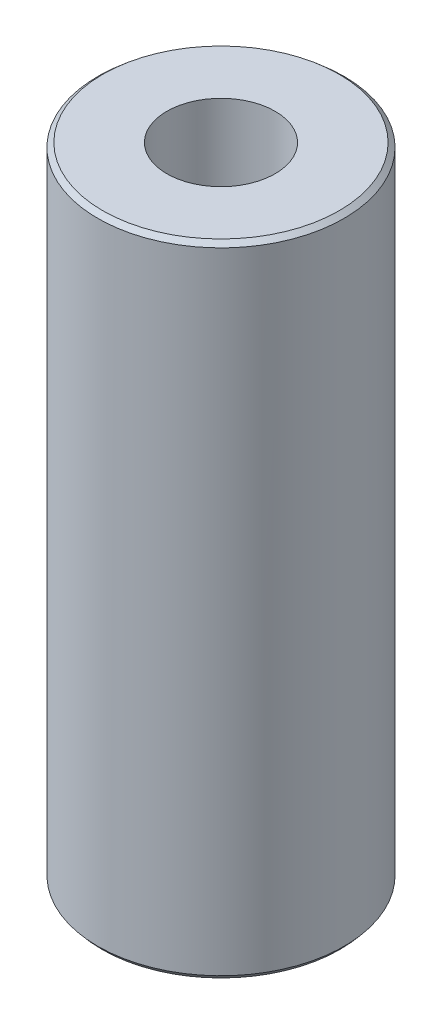
ISO-10303-21;
HEADER;
FILE_DESCRIPTION(('STEP AP214'),'2;1');
FILE_NAME('part.step','',(''),(''),'','','');
FILE_SCHEMA(('AUTOMOTIVE_DESIGN { 1 0 10303 214 1 1 1 1 }'));
ENDSEC;
DATA;
#1=APPLICATION_CONTEXT('core data for automotive mechanical design processes');
#2=APPLICATION_PROTOCOL_DEFINITION('international standard','automotive_design',2000,#1);
#3=PRODUCT_CONTEXT('',#1,'mechanical');
#4=PRODUCT('Part','Part','',(#3));
#5=PRODUCT_RELATED_PRODUCT_CATEGORY('part','',(#4));
#6=PRODUCT_DEFINITION_FORMATION('','',#4);
#7=PRODUCT_DEFINITION_CONTEXT('part definition',#1,'design');
#8=PRODUCT_DEFINITION('design','',#6,#7);
#9=PRODUCT_DEFINITION_SHAPE('','',#8);
#10=(LENGTH_UNIT() NAMED_UNIT(*) SI_UNIT(.MILLI.,.METRE.));
#11=(NAMED_UNIT(*) PLANE_ANGLE_UNIT() SI_UNIT($,.RADIAN.));
#12=(NAMED_UNIT(*) SI_UNIT($,.STERADIAN.) SOLID_ANGLE_UNIT());
#13=UNCERTAINTY_MEASURE_WITH_UNIT(LENGTH_MEASURE(1.E-05),#10,'distance_accuracy_value','');
#14=(GEOMETRIC_REPRESENTATION_CONTEXT(3) GLOBAL_UNCERTAINTY_ASSIGNED_CONTEXT((#13)) GLOBAL_UNIT_ASSIGNED_CONTEXT((#10,
#11,#12)) REPRESENTATION_CONTEXT('',''));
#15=CARTESIAN_POINT('',(0.,0.,0.));
#16=DIRECTION('',(0.,0.,1.));
#17=DIRECTION('',(1.,0.,0.));
#18=AXIS2_PLACEMENT_3D('',#15,#16,#17);
#19=CARTESIAN_POINT('',(0.,207.799958913587,0.));
#20=DIRECTION('',(0.,-1.,0.));
#21=DIRECTION('',(0.,0.,-1.));
#22=AXIS2_PLACEMENT_3D('',#19,#20,#21);
#23=CYLINDRICAL_SURFACE('',#22,40.);
#24=CARTESIAN_POINT('',(0.,206.424225681168,0.));
#25=DIRECTION('',(0.,1.,0.));
#26=DIRECTION('',(0.,0.,1.));
#27=AXIS2_PLACEMENT_3D('',#24,#25,#26);
#28=CIRCLE('',#27,40.);
#29=CARTESIAN_POINT('',(0.,206.424225681168,-40.));
#30=VERTEX_POINT('',#29);
#31=EDGE_CURVE('E50',#30,#30,#28,.F.);
#32=CARTESIAN_POINT('',(0.,1.59579462409887,0.));
#33=DIRECTION('',(0.,1.,0.));
#34=DIRECTION('',(0.,0.,1.));
#35=AXIS2_PLACEMENT_3D('',#32,#33,#34);
#36=CIRCLE('',#35,40.);
#37=CARTESIAN_POINT('',(0.,1.59579462409884,-40.));
#38=VERTEX_POINT('',#37);
#39=EDGE_CURVE('E51',#38,#38,#36,.T.);
#40=CARTESIAN_POINT('',(0.,206.424225681168,-40.));
#41=CARTESIAN_POINT('',(0.,204.29059619099,-40.));
#42=CARTESIAN_POINT('',(0.,202.156966700812,-40.));
#43=CARTESIAN_POINT('',(0.,197.889707720456,-40.));
#44=CARTESIAN_POINT('',(0.,195.756078230279,-40.));
#45=CARTESIAN_POINT('',(0.,191.488819249923,-40.));
#46=CARTESIAN_POINT('',(0.,189.355189759745,-40.));
#47=CARTESIAN_POINT('',(0.,185.08793077939,-40.));
#48=CARTESIAN_POINT('',(0.,182.954301289212,-40.));
#49=CARTESIAN_POINT('',(0.,178.687042308856,-40.));
#50=CARTESIAN_POINT('',(0.,176.553412818678,-40.));
#51=CARTESIAN_POINT('',(0.,172.286153838323,-40.));
#52=CARTESIAN_POINT('',(0.,170.152524348145,-40.));
#53=CARTESIAN_POINT('',(0.,165.885265367789,-40.));
#54=CARTESIAN_POINT('',(0.,163.751635877612,-40.));
#55=CARTESIAN_POINT('',(0.,159.484376897256,-40.));
#56=CARTESIAN_POINT('',(0.,157.350747407078,-40.));
#57=CARTESIAN_POINT('',(0.,153.083488426723,-40.));
#58=CARTESIAN_POINT('',(0.,150.949858936545,-40.));
#59=CARTESIAN_POINT('',(0.,146.682599956189,-40.));
#60=CARTESIAN_POINT('',(0.,144.548970466011,-40.));
#61=CARTESIAN_POINT('',(0.,140.281711485656,-40.));
#62=CARTESIAN_POINT('',(0.,138.148081995478,-40.));
#63=CARTESIAN_POINT('',(0.,133.880823015122,-40.));
#64=CARTESIAN_POINT('',(0.,131.747193524945,-40.));
#65=CARTESIAN_POINT('',(0.,127.479934544589,-40.));
#66=CARTESIAN_POINT('',(0.,125.346305054411,-40.));
#67=CARTESIAN_POINT('',(0.,121.079046074056,-40.));
#68=CARTESIAN_POINT('',(0.,118.945416583878,-40.));
#69=CARTESIAN_POINT('',(0.,114.678157603522,-40.));
#70=CARTESIAN_POINT('',(0.,112.544528113344,-40.));
#71=CARTESIAN_POINT('',(0.,108.277269132989,-40.));
#72=CARTESIAN_POINT('',(0.,106.143639642811,-40.));
#73=CARTESIAN_POINT('',(0.,101.876380662455,-40.));
#74=CARTESIAN_POINT('',(0.,99.7427511722776,-40.));
#75=CARTESIAN_POINT('',(0.,95.475492191922,-40.));
#76=CARTESIAN_POINT('',(0.,93.3418627017442,-40.));
#77=CARTESIAN_POINT('',(0.,89.0746037213886,-40.));
#78=CARTESIAN_POINT('',(0.,86.9409742312108,-40.));
#79=CARTESIAN_POINT('',(0.,82.6737152508552,-40.));
#80=CARTESIAN_POINT('',(0.,80.5400857606774,-40.));
#81=CARTESIAN_POINT('',(0.,76.2728267803218,-40.));
#82=CARTESIAN_POINT('',(0.,74.139197290144,-40.));
#83=CARTESIAN_POINT('',(0.,69.8719383097884,-40.));
#84=CARTESIAN_POINT('',(0.,67.7383088196106,-40.));
#85=CARTESIAN_POINT('',(0.,63.471049839255,-40.));
#86=CARTESIAN_POINT('',(0.,61.3374203490772,-40.));
#87=CARTESIAN_POINT('',(0.,57.0701613687216,-40.));
#88=CARTESIAN_POINT('',(0.,54.9365318785438,-40.));
#89=CARTESIAN_POINT('',(0.,50.6692728981882,-40.));
#90=CARTESIAN_POINT('',(0.,48.5356434080104,-40.));
#91=CARTESIAN_POINT('',(0.,44.2683844276548,-40.));
#92=CARTESIAN_POINT('',(0.,42.134754937477,-40.));
#93=CARTESIAN_POINT('',(0.,37.8674959571214,-40.));
#94=CARTESIAN_POINT('',(0.,35.7338664669436,-40.));
#95=CARTESIAN_POINT('',(0.,31.466607486588,-40.));
#96=CARTESIAN_POINT('',(0.,29.3329779964102,-40.));
#97=CARTESIAN_POINT('',(0.,25.0657190160546,-40.));
#98=CARTESIAN_POINT('',(0.,22.9320895258768,-40.));
#99=CARTESIAN_POINT('',(0.,18.6648305455213,-40.));
#100=CARTESIAN_POINT('',(0.,16.5312010553435,-40.));
#101=CARTESIAN_POINT('',(0.,12.2639420749878,-40.));
#102=CARTESIAN_POINT('',(0.,10.13031258481,-40.));
#103=CARTESIAN_POINT('',(0.,5.86305360445443,-40.));
#104=CARTESIAN_POINT('',(0.,3.72942411427663,-40.));
#105=CARTESIAN_POINT('',(0.,1.59579462409884,-40.));
#106=B_SPLINE_CURVE_WITH_KNOTS('',3,(#40,#41,#42,#43,#44,#45,#46,#47,#48,#49,#50,#51,#52,#53,
#54,#55,#56,#57,#58,#59,#60,#61,#62,#63,#64,#65,#66,#67,#68,#69,#70,#71,#72,#73,#74,#75,#76,#77,
#78,#79,#80,#81,#82,#83,#84,#85,#86,#87,#88,#89,#90,#91,#92,#93,#94,#95,#96,#97,#98,#99,#100,
#101,#102,#103,#104,#105),.UNSPECIFIED.,.F.,.F.,(4,2,2,2,2,2,2,2,2,2,2,2,2,2,2,2,2,2,2,2,2,2,2,
2,2,2,2,2,2,2,2,2,4),(0.,6.40088847053341,12.8017769410668,19.2026654116002,25.6035538821336,
32.004442352667,38.4053308232004,44.8062192937338,51.2071077642672,57.6079962348006,
64.008884705334,70.4097731758674,76.8106616464008,83.2115501169342,89.6124385874676,
96.013327058001,102.414215528534,108.815103999068,115.215992469601,121.616880940135,
128.017769410668,134.418657881201,140.819546351735,147.220434822268,153.621323292802,
160.022211763335,166.423100233868,172.823988704402,179.224877174935,185.625765645469,
192.026654116002,198.427542586535,204.828431057069),.UNSPECIFIED.);
#107=EDGE_CURVE('BSEAM39',#30,#38,#106,.T.);
#108=ORIENTED_EDGE('',*,*,#31,.T.);
#109=ORIENTED_EDGE('',*,*,#39,.T.);
#110=ORIENTED_EDGE('',*,*,#107,.T.);
#111=ORIENTED_EDGE('',*,*,#107,.F.);
#112=EDGE_LOOP('',(#108,#110,#109,#111));
#113=FACE_BOUND('',#112,.T.);
#114=ADVANCED_FACE('F39',(#113),#23,.T.);
#115=CARTESIAN_POINT('',(0.,207.799958913587,0.));
#116=DIRECTION('',(0.,1.,0.));
#117=DIRECTION('',(0.,0.,1.));
#118=AXIS2_PLACEMENT_3D('',#115,#116,#117);
#119=PLANE('',#118);
#120=CARTESIAN_POINT('',(0.,207.799958913587,0.));
#121=DIRECTION('',(0.,1.,0.));
#122=DIRECTION('',(0.,0.,1.));
#123=AXIS2_PLACEMENT_3D('',#120,#121,#122);
#124=CIRCLE('',#123,38.4042053759014);
#125=CARTESIAN_POINT('',(0.,207.799958913587,-38.4042053759015));
#126=VERTEX_POINT('',#125);
#127=EDGE_CURVE('E54',#126,#126,#124,.T.);
#128=ORIENTED_EDGE('',*,*,#127,.T.);
#129=EDGE_LOOP('',(#128));
#130=FACE_BOUND('',#129,.T.);
#131=CARTESIAN_POINT('',(0.,207.799958913587,0.));
#132=DIRECTION('',(0.,1.,0.));
#133=DIRECTION('',(0.,0.,1.));
#134=AXIS2_PLACEMENT_3D('',#131,#132,#133);
#135=CIRCLE('',#134,17.60059387778);
#136=CARTESIAN_POINT('',(0.,207.799958913587,-17.60059387778));
#137=VERTEX_POINT('',#136);
#138=EDGE_CURVE('E58',#137,#137,#135,.T.);
#139=ORIENTED_EDGE('',*,*,#138,.F.);
#140=EDGE_LOOP('',(#139));
#141=FACE_BOUND('',#140,.T.);
#142=ADVANCED_FACE('F69',(#130,#141),#119,.T.);
#143=CARTESIAN_POINT('',(0.,0.,0.));
#144=DIRECTION('',(0.,1.,0.));
#145=DIRECTION('',(0.,0.,1.));
#146=AXIS2_PLACEMENT_3D('',#143,#144,#145);
#147=PLANE('',#146);
#148=CARTESIAN_POINT('',(0.,0.,0.));
#149=DIRECTION('',(0.,1.,0.));
#150=DIRECTION('',(0.,0.,1.));
#151=AXIS2_PLACEMENT_3D('',#148,#149,#150);
#152=CIRCLE('',#151,38.6242667675802);
#153=CARTESIAN_POINT('',(0.,0.,38.6242667675802));
#154=VERTEX_POINT('',#153);
#155=EDGE_CURVE('E10',#154,#154,#152,.F.);
#156=ORIENTED_EDGE('',*,*,#155,.T.);
#157=EDGE_LOOP('',(#156));
#158=FACE_BOUND('',#157,.T.);
#159=CARTESIAN_POINT('',(0.,0.,0.));
#160=DIRECTION('',(0.,1.,0.));
#161=DIRECTION('',(0.,0.,1.));
#162=AXIS2_PLACEMENT_3D('',#159,#160,#161);
#163=CIRCLE('',#162,17.60059387778);
#164=CARTESIAN_POINT('',(0.,0.,-17.60059387778));
#165=VERTEX_POINT('',#164);
#166=EDGE_CURVE('E63',#165,#165,#163,.T.);
#167=ORIENTED_EDGE('',*,*,#166,.T.);
#168=EDGE_LOOP('',(#167));
#169=FACE_BOUND('',#168,.T.);
#170=ADVANCED_FACE('F75',(#158,#169),#147,.F.);
#171=CARTESIAN_POINT('',(0.,207.799958913587,0.));
#172=DIRECTION('',(0.,-1.,0.));
#173=DIRECTION('',(0.,0.,-1.));
#174=AXIS2_PLACEMENT_3D('',#171,#172,#173);
#175=CYLINDRICAL_SURFACE('',#174,17.60059387778);
#176=CARTESIAN_POINT('',(0.,207.799958913587,-17.60059387778));
#177=CARTESIAN_POINT('',(0.,205.635376008237,-17.60059387778));
#178=CARTESIAN_POINT('',(0.,203.470793102887,-17.60059387778));
#179=CARTESIAN_POINT('',(0.,199.141627292188,-17.60059387778));
#180=CARTESIAN_POINT('',(0.,196.977044386838,-17.60059387778));
#181=CARTESIAN_POINT('',(0.,192.647878576138,-17.60059387778));
#182=CARTESIAN_POINT('',(0.,190.483295670788,-17.60059387778));
#183=CARTESIAN_POINT('',(0.,186.154129860088,-17.60059387778));
#184=CARTESIAN_POINT('',(0.,183.989546954739,-17.60059387778));
#185=CARTESIAN_POINT('',(0.,179.660381144039,-17.60059387778));
#186=CARTESIAN_POINT('',(0.,177.495798238689,-17.60059387778));
#187=CARTESIAN_POINT('',(0.,173.166632427989,-17.60059387778));
#188=CARTESIAN_POINT('',(0.,171.002049522639,-17.60059387778));
#189=CARTESIAN_POINT('',(0.,166.67288371194,-17.60059387778));
#190=CARTESIAN_POINT('',(0.,164.50830080659,-17.60059387778));
#191=CARTESIAN_POINT('',(0.,160.17913499589,-17.60059387778));
#192=CARTESIAN_POINT('',(0.,158.01455209054,-17.60059387778));
#193=CARTESIAN_POINT('',(0.,153.68538627984,-17.60059387778));
#194=CARTESIAN_POINT('',(0.,151.520803374491,-17.60059387778));
#195=CARTESIAN_POINT('',(0.,147.191637563791,-17.60059387778));
#196=CARTESIAN_POINT('',(0.,145.027054658441,-17.60059387778));
#197=CARTESIAN_POINT('',(0.,140.697888847741,-17.60059387778));
#198=CARTESIAN_POINT('',(0.,138.533305942391,-17.60059387778));
#199=CARTESIAN_POINT('',(0.,134.204140131692,-17.60059387778));
#200=CARTESIAN_POINT('',(0.,132.039557226342,-17.60059387778));
#201=CARTESIAN_POINT('',(0.,127.710391415642,-17.60059387778));
#202=CARTESIAN_POINT('',(0.,125.545808510292,-17.60059387778));
#203=CARTESIAN_POINT('',(0.,121.216642699592,-17.60059387778));
#204=CARTESIAN_POINT('',(0.,119.052059794243,-17.60059387778));
#205=CARTESIAN_POINT('',(0.,114.722893983543,-17.60059387778));
#206=CARTESIAN_POINT('',(0.,112.558311078193,-17.60059387778));
#207=CARTESIAN_POINT('',(0.,108.229145267493,-17.60059387778));
#208=CARTESIAN_POINT('',(0.,106.064562362143,-17.60059387778));
#209=CARTESIAN_POINT('',(0.,101.735396551444,-17.60059387778));
#210=CARTESIAN_POINT('',(0.,99.5708136460938,-17.60059387778));
#211=CARTESIAN_POINT('',(0.,95.241647835394,-17.60059387778));
#212=CARTESIAN_POINT('',(0.,93.0770649300442,-17.60059387778));
#213=CARTESIAN_POINT('',(0.,88.7478991193444,-17.60059387778));
#214=CARTESIAN_POINT('',(0.,86.5833162139946,-17.60059387778));
#215=CARTESIAN_POINT('',(0.,82.2541504032949,-17.60059387778));
#216=CARTESIAN_POINT('',(0.,80.089567497945,-17.60059387778));
#217=CARTESIAN_POINT('',(0.,75.7604016872453,-17.60059387778));
#218=CARTESIAN_POINT('',(0.,73.5958187818954,-17.60059387778));
#219=CARTESIAN_POINT('',(0.,69.2666529711957,-17.60059387778));
#220=CARTESIAN_POINT('',(0.,67.1020700658458,-17.60059387778));
#221=CARTESIAN_POINT('',(0.,62.7729042551461,-17.60059387778));
#222=CARTESIAN_POINT('',(0.,60.6083213497962,-17.60059387778));
#223=CARTESIAN_POINT('',(0.,56.2791555390965,-17.60059387778));
#224=CARTESIAN_POINT('',(0.,54.1145726337466,-17.60059387778));
#225=CARTESIAN_POINT('',(0.,49.7854068230469,-17.60059387778));
#226=CARTESIAN_POINT('',(0.,47.620823917697,-17.60059387778));
#227=CARTESIAN_POINT('',(0.,43.2916581069973,-17.60059387778));
#228=CARTESIAN_POINT('',(0.,41.1270752016474,-17.60059387778));
#229=CARTESIAN_POINT('',(0.,36.7979093909477,-17.60059387778));
#230=CARTESIAN_POINT('',(0.,34.6333264855978,-17.60059387778));
#231=CARTESIAN_POINT('',(0.,30.3041606748981,-17.60059387778));
#232=CARTESIAN_POINT('',(0.,28.1395777695482,-17.60059387778));
#233=CARTESIAN_POINT('',(0.,23.8104119588485,-17.60059387778));
#234=CARTESIAN_POINT('',(0.,21.6458290534986,-17.60059387778));
#235=CARTESIAN_POINT('',(0.,17.3166632427989,-17.60059387778));
#236=CARTESIAN_POINT('',(0.,15.152080337449,-17.60059387778));
#237=CARTESIAN_POINT('',(0.,10.8229145267493,-17.60059387778));
#238=CARTESIAN_POINT('',(0.,8.65833162139944,-17.60059387778));
#239=CARTESIAN_POINT('',(0.,4.32916581069971,-17.60059387778));
#240=CARTESIAN_POINT('',(0.,2.16458290534984,-17.60059387778));
#241=CARTESIAN_POINT('',(0.,0.,-17.60059387778));
#242=B_SPLINE_CURVE_WITH_KNOTS('',3,(#176,#177,#178,#179,#180,#181,#182,#183,#184,#185,#186,
#187,#188,#189,#190,#191,#192,#193,#194,#195,#196,#197,#198,#199,#200,#201,#202,#203,#204,#205,
#206,#207,#208,#209,#210,#211,#212,#213,#214,#215,#216,#217,#218,#219,#220,#221,#222,#223,#224,
#225,#226,#227,#228,#229,#230,#231,#232,#233,#234,#235,#236,#237,#238,#239,#240,#241),
.UNSPECIFIED.,.F.,.F.,(4,2,2,2,2,2,2,2,2,2,2,2,2,2,2,2,2,2,2,2,2,2,2,2,2,2,2,2,2,2,2,2,4),(0.,
6.4937487160496,12.9874974320992,19.4812461481488,25.9749948641984,32.468743580248,
38.9624922962976,45.4562410123472,51.9499897283968,58.4437384444464,64.937487160496,
71.4312358765456,77.9249845925952,84.4187333086448,90.9124820246944,97.406230740744,
103.899979456794,110.393728172843,116.887476888893,123.381225604942,129.874974320992,
136.368723037042,142.862471753091,149.356220469141,155.84996918519,162.34371790124,
168.837466617289,175.331215333339,181.824964049389,188.318712765438,194.812461481488,
201.306210197537,207.799958913587),.UNSPECIFIED.);
#243=EDGE_CURVE('BSEAM70',#137,#165,#242,.T.);
#244=ORIENTED_EDGE('',*,*,#138,.T.);
#245=ORIENTED_EDGE('',*,*,#166,.F.);
#246=ORIENTED_EDGE('',*,*,#243,.T.);
#247=ORIENTED_EDGE('',*,*,#243,.F.);
#248=EDGE_LOOP('',(#244,#246,#245,#247));
#249=FACE_BOUND('',#248,.T.);
#250=ADVANCED_FACE('F70',(#249),#175,.F.);
#251=CARTESIAN_POINT('',(0.,207.799958913587,0.));
#252=DIRECTION('',(0.,-1.,0.));
#253=DIRECTION('',(0.,0.,-1.));
#254=AXIS2_PLACEMENT_3D('',#251,#252,#253);
#255=CONICAL_SURFACE('',#254,38.4042053759014,0.859319869781407);
#256=CARTESIAN_POINT('',(0.,206.424225681168,-40.));
#257=CARTESIAN_POINT('',(0.,206.438556235672,-39.9833771393323));
#258=CARTESIAN_POINT('',(0.,206.452886790176,-39.9667542786646));
#259=CARTESIAN_POINT('',(0.,206.481547899185,-39.9335085573292));
#260=CARTESIAN_POINT('',(0.,206.495878453689,-39.9168856966615));
#261=CARTESIAN_POINT('',(0.,206.524539562698,-39.8836399753262));
#262=CARTESIAN_POINT('',(0.,206.538870117203,-39.8670171146585));
#263=CARTESIAN_POINT('',(0.,206.567531226211,-39.8337713933231));
#264=CARTESIAN_POINT('',(0.,206.581861780716,-39.8171485326554));
#265=CARTESIAN_POINT('',(0.,206.610522889724,-39.78390281132));
#266=CARTESIAN_POINT('',(0.,206.624853444229,-39.7672799506523));
#267=CARTESIAN_POINT('',(0.,206.653514553237,-39.7340342293169));
#268=CARTESIAN_POINT('',(0.,206.667845107742,-39.7174113686492));
#269=CARTESIAN_POINT('',(0.,206.696506216751,-39.6841656473138));
#270=CARTESIAN_POINT('',(0.,206.710836771255,-39.6675427866461));
#271=CARTESIAN_POINT('',(0.,206.739497880264,-39.6342970653108));
#272=CARTESIAN_POINT('',(0.,206.753828434768,-39.6176742046431));
#273=CARTESIAN_POINT('',(0.,206.782489543777,-39.5844284833077));
#274=CARTESIAN_POINT('',(0.,206.796820098281,-39.56780562264));
#275=CARTESIAN_POINT('',(0.,206.82548120729,-39.5345599013046));
#276=CARTESIAN_POINT('',(0.,206.839811761794,-39.5179370406369));
#277=CARTESIAN_POINT('',(0.,206.868472870803,-39.4846913193015));
#278=CARTESIAN_POINT('',(0.,206.882803425307,-39.4680684586338));
#279=CARTESIAN_POINT('',(0.,206.911464534316,-39.4348227372984));
#280=CARTESIAN_POINT('',(0.,206.92579508882,-39.4181998766308));
#281=CARTESIAN_POINT('',(0.,206.954456197829,-39.3849541552954));
#282=CARTESIAN_POINT('',(0.,206.968786752334,-39.3683312946277));
#283=CARTESIAN_POINT('',(0.,206.997447861342,-39.3350855732923));
#284=CARTESIAN_POINT('',(0.,207.011778415847,-39.3184627126246));
#285=CARTESIAN_POINT('',(0.,207.040439524855,-39.2852169912892));
#286=CARTESIAN_POINT('',(0.,207.05477007936,-39.2685941306215));
#287=CARTESIAN_POINT('',(0.,207.083431188369,-39.2353484092861));
#288=CARTESIAN_POINT('',(0.,207.097761742873,-39.2187255486184));
#289=CARTESIAN_POINT('',(0.,207.126422851882,-39.185479827283));
#290=CARTESIAN_POINT('',(0.,207.140753406386,-39.1688569666153));
#291=CARTESIAN_POINT('',(0.,207.169414515395,-39.13561124528));
#292=CARTESIAN_POINT('',(0.,207.183745069899,-39.1189883846123));
#293=CARTESIAN_POINT('',(0.,207.212406178908,-39.0857426632769));
#294=CARTESIAN_POINT('',(0.,207.226736733412,-39.0691198026092));
#295=CARTESIAN_POINT('',(0.,207.255397842421,-39.0358740812738));
#296=CARTESIAN_POINT('',(0.,207.269728396925,-39.0192512206061));
#297=CARTESIAN_POINT('',(0.,207.298389505934,-38.9860054992707));
#298=CARTESIAN_POINT('',(0.,207.312720060438,-38.969382638603));
#299=CARTESIAN_POINT('',(0.,207.341381169447,-38.9361369172676));
#300=CARTESIAN_POINT('',(0.,207.355711723952,-38.9195140566));
#301=CARTESIAN_POINT('',(0.,207.38437283296,-38.8862683352646));
#302=CARTESIAN_POINT('',(0.,207.398703387465,-38.8696454745969));
#303=CARTESIAN_POINT('',(0.,207.427364496473,-38.8363997532615));
#304=CARTESIAN_POINT('',(0.,207.441695050978,-38.8197768925938));
#305=CARTESIAN_POINT('',(0.,207.470356159987,-38.7865311712584));
#306=CARTESIAN_POINT('',(0.,207.484686714491,-38.7699083105907));
#307=CARTESIAN_POINT('',(0.,207.5133478235,-38.7366625892553));
#308=CARTESIAN_POINT('',(0.,207.527678378004,-38.7200397285876));
#309=CARTESIAN_POINT('',(0.,207.556339487013,-38.6867940072522));
#310=CARTESIAN_POINT('',(0.,207.570670041517,-38.6701711465845));
#311=CARTESIAN_POINT('',(0.,207.599331150526,-38.6369254252492));
#312=CARTESIAN_POINT('',(0.,207.61366170503,-38.6203025645815));
#313=CARTESIAN_POINT('',(0.,207.642322814039,-38.5870568432461));
#314=CARTESIAN_POINT('',(0.,207.656653368543,-38.5704339825784));
#315=CARTESIAN_POINT('',(0.,207.685314477552,-38.537188261243));
#316=CARTESIAN_POINT('',(0.,207.699645032056,-38.5205654005753));
#317=CARTESIAN_POINT('',(0.,207.728306141065,-38.4873196792399));
#318=CARTESIAN_POINT('',(0.,207.74263669557,-38.4706968185722));
#319=CARTESIAN_POINT('',(0.,207.771297804578,-38.4374510972368));
#320=CARTESIAN_POINT('',(0.,207.785628359083,-38.4208282365691));
#321=CARTESIAN_POINT('',(0.,207.799958913587,-38.4042053759015));
#322=B_SPLINE_CURVE_WITH_KNOTS('',3,(#256,#257,#258,#259,#260,#261,#262,#263,#264,#265,#266,
#267,#268,#269,#270,#271,#272,#273,#274,#275,#276,#277,#278,#279,#280,#281,#282,#283,#284,#285,
#286,#287,#288,#289,#290,#291,#292,#293,#294,#295,#296,#297,#298,#299,#300,#301,#302,#303,#304,
#305,#306,#307,#308,#309,#310,#311,#312,#313,#314,#315,#316,#317,#318,#319,#320,#321),
.UNSPECIFIED.,.F.,.F.,(4,2,2,2,2,2,2,2,2,2,2,2,2,2,2,2,2,2,2,2,2,2,2,2,2,2,2,2,2,2,2,2,4),(0.,
0.0658419213162956,0.131683842632591,0.197525763948905,0.2633676852652,0.329209606581514,
0.39505152789781,0.460893449214111,0.526735370530424,0.59257729184672,0.658419213163034,
0.724261134479329,0.790103055795625,0.855944977111938,0.921786898428234,0.987628819744553,
1.05347074106085,1.11931266237714,1.18515458369346,1.25099650500975,1.31683842632607,
1.38268034764236,1.44852226895866,1.51436419027498,1.58020611159127,1.64604803290759,
1.71188995422388,1.77773187554018,1.84357379685649,1.90941571817279,1.9752576394891,
2.0410995608054,2.10694148212172),.UNSPECIFIED.);
#323=EDGE_CURVE('BSEAM81',#30,#126,#322,.T.);
#324=ORIENTED_EDGE('',*,*,#31,.F.);
#325=ORIENTED_EDGE('',*,*,#127,.F.);
#326=ORIENTED_EDGE('',*,*,#323,.T.);
#327=ORIENTED_EDGE('',*,*,#323,.F.);
#328=EDGE_LOOP('',(#324,#326,#325,#327));
#329=FACE_BOUND('',#328,.T.);
#330=ADVANCED_FACE('F81',(#329),#255,.T.);
#331=CARTESIAN_POINT('',(0.,1.59579462409887,0.));
#332=DIRECTION('',(0.,1.,0.));
#333=DIRECTION('',(0.,0.,1.));
#334=AXIS2_PLACEMENT_3D('',#331,#332,#333);
#335=CONICAL_SURFACE('',#334,40.,0.71147645701349);
#336=ORIENTED_EDGE('',*,*,#155,.F.);
#337=EDGE_LOOP('',(#336));
#338=FACE_BOUND('',#337,.T.);
#339=ORIENTED_EDGE('',*,*,#39,.F.);
#340=EDGE_LOOP('',(#339));
#341=FACE_BOUND('',#340,.T.);
#342=ADVANCED_FACE('F45',(#338,#341),#335,.T.);
#343=CLOSED_SHELL('',(#114,#142,#170,#250,#330,#342));
#344=MANIFOLD_SOLID_BREP('B2',#343);
#345=ADVANCED_BREP_SHAPE_REPRESENTATION('',(#18,#344),#14);
#346=SHAPE_DEFINITION_REPRESENTATION(#9,#345);
ENDSEC;
END-ISO-10303-21;
